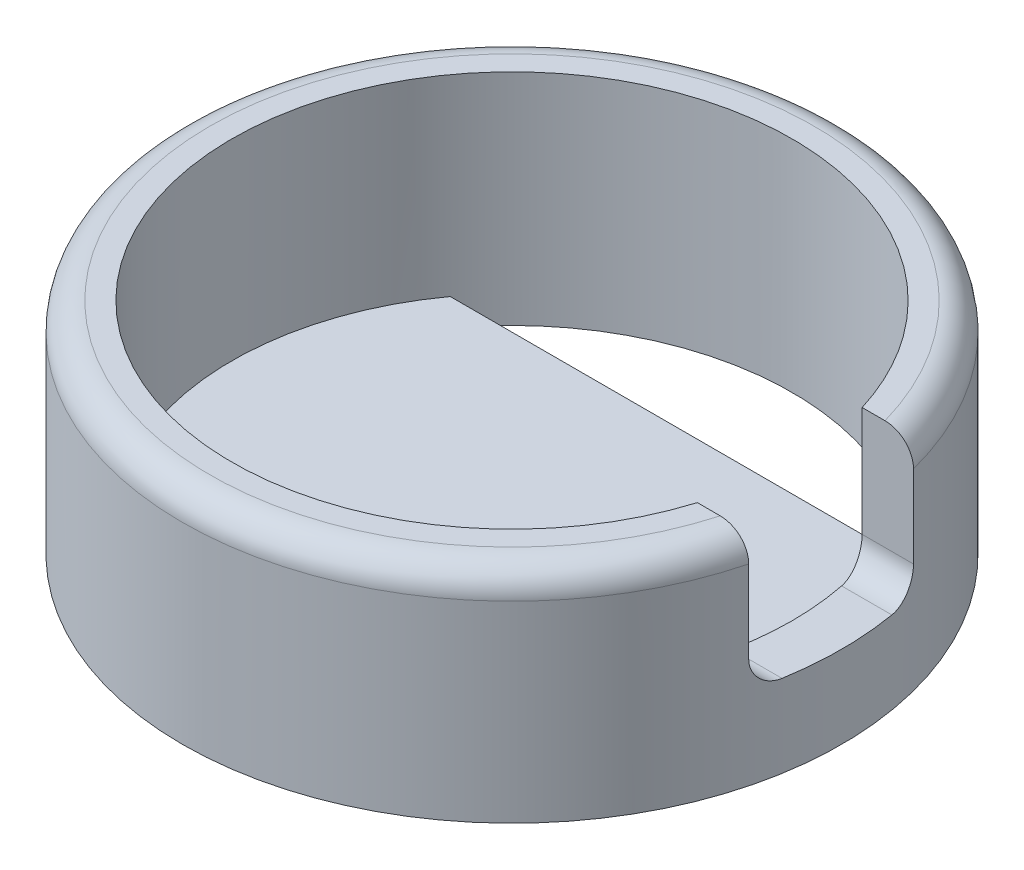
ISO-10303-21;
HEADER;
FILE_DESCRIPTION(('STEP AP214'),'2;1');
FILE_NAME('part.step','',(''),(''),'','','');
FILE_SCHEMA(('AUTOMOTIVE_DESIGN { 1 0 10303 214 1 1 1 1 }'));
ENDSEC;
DATA;
#1=APPLICATION_CONTEXT('core data for automotive mechanical design processes');
#2=APPLICATION_PROTOCOL_DEFINITION('international standard','automotive_design',2000,#1);
#3=PRODUCT_CONTEXT('',#1,'mechanical');
#4=PRODUCT('Part','Part','',(#3));
#5=PRODUCT_RELATED_PRODUCT_CATEGORY('part','',(#4));
#6=PRODUCT_DEFINITION_FORMATION('','',#4);
#7=PRODUCT_DEFINITION_CONTEXT('part definition',#1,'design');
#8=PRODUCT_DEFINITION('design','',#6,#7);
#9=PRODUCT_DEFINITION_SHAPE('','',#8);
#10=(LENGTH_UNIT() NAMED_UNIT(*) SI_UNIT(.MILLI.,.METRE.));
#11=(NAMED_UNIT(*) PLANE_ANGLE_UNIT() SI_UNIT($,.RADIAN.));
#12=(NAMED_UNIT(*) SI_UNIT($,.STERADIAN.) SOLID_ANGLE_UNIT());
#13=UNCERTAINTY_MEASURE_WITH_UNIT(LENGTH_MEASURE(1.E-05),#10,'distance_accuracy_value','');
#14=(GEOMETRIC_REPRESENTATION_CONTEXT(3) GLOBAL_UNCERTAINTY_ASSIGNED_CONTEXT((#13)) GLOBAL_UNIT_ASSIGNED_CONTEXT((#10,
#11,#12)) REPRESENTATION_CONTEXT('',''));
#15=CARTESIAN_POINT('',(0.,0.,0.));
#16=DIRECTION('',(0.,0.,1.));
#17=DIRECTION('',(1.,0.,0.));
#18=AXIS2_PLACEMENT_3D('',#15,#16,#17);
#19=CARTESIAN_POINT('',(0.,0.,0.));
#20=DIRECTION('',(0.,-1.,0.));
#21=DIRECTION('',(0.,0.,-1.));
#22=AXIS2_PLACEMENT_3D('',#19,#20,#21);
#23=PLANE('',#22);
#24=CARTESIAN_POINT('',(0.,0.,0.));
#25=DIRECTION('',(0.,1.,0.));
#26=DIRECTION('',(0.,0.,1.));
#27=AXIS2_PLACEMENT_3D('',#24,#25,#26);
#28=CIRCLE('',#27,5.1);
#29=CARTESIAN_POINT('',(4.12431812546026,0.,3.));
#30=VERTEX_POINT('',#29);
#31=CARTESIAN_POINT('',(4.12431812546026,0.,-3.));
#32=VERTEX_POINT('',#31);
#33=EDGE_CURVE('E171',#30,#32,#28,.T.);
#34=ORIENTED_EDGE('',*,*,#33,.T.);
#35=DIRECTION('',(1.,0.,0.));
#36=VECTOR('',#35,1.);
#37=CARTESIAN_POINT('',(4.12431812546025,0.,-3.));
#38=LINE('',#37,#36);
#39=CARTESIAN_POINT('',(-4.12431812546025,0.,-3.));
#40=VERTEX_POINT('',#39);
#41=EDGE_CURVE('E140',#40,#32,#38,.T.);
#42=ORIENTED_EDGE('',*,*,#41,.F.);
#43=CARTESIAN_POINT('',(-4.12431812546025,0.,3.));
#44=VERTEX_POINT('',#43);
#45=EDGE_CURVE('E128',#40,#44,#28,.T.);
#46=ORIENTED_EDGE('',*,*,#45,.T.);
#47=DIRECTION('',(-1.,0.,0.));
#48=VECTOR('',#47,1.);
#49=CARTESIAN_POINT('',(4.12431812546025,0.,3.));
#50=LINE('',#49,#48);
#51=EDGE_CURVE('E144',#30,#44,#50,.T.);
#52=ORIENTED_EDGE('',*,*,#51,.F.);
#53=EDGE_LOOP('',(#34,#42,#46,#52));
#54=FACE_BOUND('',#53,.T.);
#55=ADVANCED_FACE('F32',(#54),#23,.F.);
#56=CARTESIAN_POINT('',(0.,3.5,0.));
#57=DIRECTION('',(0.,1.,0.));
#58=DIRECTION('',(0.,0.,1.));
#59=AXIS2_PLACEMENT_3D('',#56,#57,#58);
#60=PLANE('',#59);
#61=DIRECTION('',(1.,0.,0.));
#62=VECTOR('',#61,1.);
#63=CARTESIAN_POINT('',(0.,3.5,-1.5));
#64=LINE('',#63,#62);
#65=CARTESIAN_POINT('',(4.87442304278157,3.5,-1.5));
#66=VERTEX_POINT('',#65);
#67=CARTESIAN_POINT('',(5.29150262212918,3.5,-1.5));
#68=VERTEX_POINT('',#67);
#69=EDGE_CURVE('E155',#66,#68,#64,.T.);
#70=ORIENTED_EDGE('',*,*,#69,.T.);
#71=CARTESIAN_POINT('',(0.,3.5,0.));
#72=DIRECTION('',(0.,1.,0.));
#73=DIRECTION('',(0.,0.,1.));
#74=AXIS2_PLACEMENT_3D('',#71,#72,#73);
#75=CIRCLE('',#74,5.5);
#76=CARTESIAN_POINT('',(5.29150262212918,3.5,1.5));
#77=VERTEX_POINT('',#76);
#78=EDGE_CURVE('E173',#68,#77,#75,.T.);
#79=ORIENTED_EDGE('',*,*,#78,.T.);
#80=DIRECTION('',(-1.,0.,0.));
#81=VECTOR('',#80,1.);
#82=CARTESIAN_POINT('',(0.,3.5,1.5));
#83=LINE('',#82,#81);
#84=CARTESIAN_POINT('',(4.87442304278157,3.5,1.5));
#85=VERTEX_POINT('',#84);
#86=EDGE_CURVE('E252',#77,#85,#83,.T.);
#87=ORIENTED_EDGE('',*,*,#86,.T.);
#88=CARTESIAN_POINT('',(0.,3.5,0.));
#89=DIRECTION('',(0.,1.,0.));
#90=DIRECTION('',(0.,0.,1.));
#91=AXIS2_PLACEMENT_3D('',#88,#89,#90);
#92=CIRCLE('',#91,5.1);
#93=EDGE_CURVE('E266',#66,#85,#92,.T.);
#94=ORIENTED_EDGE('',*,*,#93,.F.);
#95=EDGE_LOOP('',(#70,#79,#87,#94));
#96=FACE_BOUND('',#95,.T.);
#97=ADVANCED_FACE('F220',(#96),#60,.T.);
#98=CARTESIAN_POINT('',(0.,3.5,0.));
#99=DIRECTION('',(0.,-1.,0.));
#100=DIRECTION('',(0.,0.,-1.));
#101=AXIS2_PLACEMENT_3D('',#98,#99,#100);
#102=CYLINDRICAL_SURFACE('',#101,6.);
#103=CARTESIAN_POINT('',(0.,-0.5,0.));
#104=DIRECTION('',(0.,-1.,0.));
#105=DIRECTION('',(0.,0.,-1.));
#106=AXIS2_PLACEMENT_3D('',#103,#104,#105);
#107=CIRCLE('',#106,6.);
#108=CARTESIAN_POINT('',(0.,-0.5,-6.));
#109=VERTEX_POINT('',#108);
#110=EDGE_CURVE('E172',#109,#109,#107,.T.);
#111=ORIENTED_EDGE('',*,*,#110,.F.);
#112=EDGE_LOOP('',(#111));
#113=FACE_BOUND('',#112,.T.);
#114=DIRECTION('',(0.,-1.,0.));
#115=VECTOR('',#114,1.);
#116=CARTESIAN_POINT('',(5.80947501931113,3.5,1.5));
#117=LINE('',#116,#115);
#118=CARTESIAN_POINT('',(5.80947501931113,3.,1.5));
#119=VERTEX_POINT('',#118);
#120=CARTESIAN_POINT('',(5.80947501931113,1.5,1.5));
#121=VERTEX_POINT('',#120);
#122=EDGE_CURVE('E251',#119,#121,#117,.T.);
#123=ORIENTED_EDGE('',*,*,#122,.F.);
#124=CARTESIAN_POINT('',(0.,3.,0.));
#125=DIRECTION('',(0.,1.,0.));
#126=DIRECTION('',(0.,0.,1.));
#127=AXIS2_PLACEMENT_3D('',#124,#125,#126);
#128=CIRCLE('',#127,6.);
#129=CARTESIAN_POINT('',(5.80947501931113,3.,-1.5));
#130=VERTEX_POINT('',#129);
#131=EDGE_CURVE('E187',#119,#130,#128,.F.);
#132=ORIENTED_EDGE('',*,*,#131,.T.);
#133=DIRECTION('',(0.,-1.,0.));
#134=VECTOR('',#133,1.);
#135=CARTESIAN_POINT('',(5.80947501931113,3.5,-1.5));
#136=LINE('',#135,#134);
#137=CARTESIAN_POINT('',(5.80947501931113,1.5,-1.5));
#138=VERTEX_POINT('',#137);
#139=EDGE_CURVE('E245',#138,#130,#136,.F.);
#140=ORIENTED_EDGE('',*,*,#139,.F.);
#141=CARTESIAN_POINT('',(5.80947501931113,1.5,-1.5));
#142=CARTESIAN_POINT('',(5.80946260272225,1.47245234394303,-1.5000264388775));
#143=CARTESIAN_POINT('',(5.81006232529152,1.44491875321877,-1.49772513568713));
#144=CARTESIAN_POINT('',(5.81239183886436,1.39069268979506,-1.48867054127598));
#145=CARTESIAN_POINT('',(5.81411955169529,1.36399876473653,-1.48192543696267));
#146=CARTESIAN_POINT('',(5.81861164863412,1.31215613754131,-1.46418467978733));
#147=CARTESIAN_POINT('',(5.82137611529369,1.28700755863868,-1.45318868844561));
#148=CARTESIAN_POINT('',(5.82777770640467,1.23892533964038,-1.42730002983229));
#149=CARTESIAN_POINT('',(5.83141495801916,1.21599202298769,-1.41240679471109));
#150=CARTESIAN_POINT('',(5.83943185842595,1.17257483931313,-1.37888943193051));
#151=CARTESIAN_POINT('',(5.8438226013859,1.15213678395909,-1.36020865851627));
#152=CARTESIAN_POINT('',(5.85308115729669,1.11465845161131,-1.31979926314509));
#153=CARTESIAN_POINT('',(5.85794910314797,1.09761912519205,-1.29806979139856));
#154=CARTESIAN_POINT('',(5.86807359237805,1.06694381207257,-1.25151686538783));
#155=CARTESIAN_POINT('',(5.87333714435984,1.05341443104465,-1.22662470361615));
#156=CARTESIAN_POINT('',(5.88389673242732,1.03074930338266,-1.17492720494232));
#157=CARTESIAN_POINT('',(5.88919275307265,1.02161161102753,-1.14812272134344));
#158=CARTESIAN_POINT('',(5.89814802867448,1.00989039601375,-1.1010233989768));
#159=CARTESIAN_POINT('',(5.90185029888455,1.00618802406004,-1.08100778606736));
#160=CARTESIAN_POINT('',(5.90909720818695,1.00124239117992,-1.04067055279438));
#161=CARTESIAN_POINT('',(5.91264201779594,0.99999640343558,-1.02034929701292));
#162=CARTESIAN_POINT('',(5.91607978309962,1.,-1.));
#163=B_SPLINE_CURVE_WITH_KNOTS('',3,(#141,#142,#143,#144,#145,#146,#147,#148,#149,#150,#151,
#152,#153,#154,#155,#156,#157,#158,#159,#160,#161,#162),.UNSPECIFIED.,.F.,.F.,(4,2,2,2,2,2,2,2,
2,2,4),(0.,0.0825190739674022,0.164886544864223,0.247260575676912,0.329646615522718,
0.413370197857709,0.497117163713627,0.583169637417716,0.669183950673288,0.731109654210456,
0.792966575586024),.UNSPECIFIED.);
#164=CARTESIAN_POINT('',(5.91607978309962,1.,-1.));
#165=VERTEX_POINT('',#164);
#166=EDGE_CURVE('E45',#138,#165,#163,.T.);
#167=ORIENTED_EDGE('',*,*,#166,.T.);
#168=CARTESIAN_POINT('',(0.,1.,0.));
#169=DIRECTION('',(0.,-1.,0.));
#170=DIRECTION('',(0.,0.,-1.));
#171=AXIS2_PLACEMENT_3D('',#168,#169,#170);
#172=CIRCLE('',#171,6.);
#173=CARTESIAN_POINT('',(5.91607978309962,1.,1.));
#174=VERTEX_POINT('',#173);
#175=EDGE_CURVE('E242',#165,#174,#172,.T.);
#176=ORIENTED_EDGE('',*,*,#175,.T.);
#177=CARTESIAN_POINT('',(5.91607978309962,1.,1.));
#178=CARTESIAN_POINT('',(5.91124844688036,0.999978854490423,1.02863076528655));
#179=CARTESIAN_POINT('',(5.90619562137501,1.00245763755017,1.0572122635172));
#180=CARTESIAN_POINT('',(5.89584284522348,1.01221729737715,1.11347612360845));
#181=CARTESIAN_POINT('',(5.89054308215667,1.01949458262758,1.14115914170437));
#182=CARTESIAN_POINT('',(5.8798830515727,1.03865661381043,1.19487780890017));
#183=CARTESIAN_POINT('',(5.87452276814994,1.05054259969208,1.22091301246864));
#184=CARTESIAN_POINT('',(5.86397538489915,1.07858989055555,1.27060482095105));
#185=CARTESIAN_POINT('',(5.85878826840729,1.09475078282027,1.29426165517847));
#186=CARTESIAN_POINT('',(5.84882871455614,1.13094460117043,1.33855140011155));
#187=CARTESIAN_POINT('',(5.84405675928205,1.15098194383714,1.35918081396686));
#188=CARTESIAN_POINT('',(5.83518768297033,1.19438636263682,1.39676716424024));
#189=CARTESIAN_POINT('',(5.83109063783287,1.21775381272213,1.41372368767373));
#190=CARTESIAN_POINT('',(5.82387518217024,1.26673249328472,1.44315778903523));
#191=CARTESIAN_POINT('',(5.82074106784856,1.2922979140944,1.45570777604623));
#192=CARTESIAN_POINT('',(5.81555164563027,1.34527358514939,1.47630380393845));
#193=CARTESIAN_POINT('',(5.81349525719888,1.37268195640367,1.48435435652113));
#194=CARTESIAN_POINT('',(5.81119297097694,1.416931541816,1.49333436328146));
#195=CARTESIAN_POINT('',(5.81054998706872,1.43344990261393,1.49583211860708));
#196=CARTESIAN_POINT('',(5.80969073993498,1.46664269790988,1.49916462086055));
#197=CARTESIAN_POINT('',(5.8094739230246,1.48331690157985,1.50000152561307));
#198=CARTESIAN_POINT('',(5.80947501931113,1.5,1.5));
#199=B_SPLINE_CURVE_WITH_KNOTS('',3,(#177,#178,#179,#180,#181,#182,#183,#184,#185,#186,#187,
#188,#189,#190,#191,#192,#193,#194,#195,#196,#197,#198),.UNSPECIFIED.,.F.,.F.,(4,2,2,2,2,2,2,2,
2,2,4),(0.,0.086983738657892,0.173902446713839,0.260844556084092,0.347778274765876,
0.434811629800413,0.521854765904096,0.607392095030617,0.69284349903057,0.742918224722482,
0.792927849191008),.UNSPECIFIED.);
#200=EDGE_CURVE('E230',#174,#121,#199,.T.);
#201=ORIENTED_EDGE('',*,*,#200,.T.);
#202=EDGE_LOOP('',(#123,#132,#140,#167,#176,#201));
#203=FACE_BOUND('',#202,.T.);
#204=ADVANCED_FACE('F199',(#113,#203),#102,.T.);
#205=CARTESIAN_POINT('',(0.,3.5,0.));
#206=DIRECTION('',(0.,-1.,0.));
#207=DIRECTION('',(0.,0.,-1.));
#208=AXIS2_PLACEMENT_3D('',#205,#206,#207);
#209=CYLINDRICAL_SURFACE('',#208,5.1);
#210=ORIENTED_EDGE('',*,*,#33,.F.);
#211=DIRECTION('',(0.,1.,0.));
#212=VECTOR('',#211,1.);
#213=CARTESIAN_POINT('',(4.12431812546025,-0.5,3.));
#214=LINE('',#213,#212);
#215=CARTESIAN_POINT('',(4.12431812546025,-0.5,3.));
#216=VERTEX_POINT('',#215);
#217=EDGE_CURVE('E152',#216,#30,#214,.T.);
#218=ORIENTED_EDGE('',*,*,#217,.F.);
#219=CARTESIAN_POINT('',(0.,-0.5,0.));
#220=DIRECTION('',(0.,1.,0.));
#221=DIRECTION('',(0.,0.,1.));
#222=AXIS2_PLACEMENT_3D('',#219,#220,#221);
#223=CIRCLE('',#222,5.1);
#224=CARTESIAN_POINT('',(-4.12431812546025,-0.5,3.));
#225=VERTEX_POINT('',#224);
#226=EDGE_CURVE('E146',#225,#216,#223,.T.);
#227=ORIENTED_EDGE('',*,*,#226,.F.);
#228=DIRECTION('',(0.,1.,0.));
#229=VECTOR('',#228,1.);
#230=CARTESIAN_POINT('',(-4.12431812546025,-0.5,3.));
#231=LINE('',#230,#229);
#232=EDGE_CURVE('E164',#225,#44,#231,.T.);
#233=ORIENTED_EDGE('',*,*,#232,.T.);
#234=ORIENTED_EDGE('',*,*,#45,.F.);
#235=DIRECTION('',(0.,1.,0.));
#236=VECTOR('',#235,1.);
#237=CARTESIAN_POINT('',(-4.12431812546025,-0.5,-3.));
#238=LINE('',#237,#236);
#239=CARTESIAN_POINT('',(-4.12431812546025,-0.5,-3.));
#240=VERTEX_POINT('',#239);
#241=EDGE_CURVE('E119',#240,#40,#238,.T.);
#242=ORIENTED_EDGE('',*,*,#241,.F.);
#243=CARTESIAN_POINT('',(0.,-0.5,0.));
#244=DIRECTION('',(0.,1.,0.));
#245=DIRECTION('',(0.,0.,1.));
#246=AXIS2_PLACEMENT_3D('',#243,#244,#245);
#247=CIRCLE('',#246,5.1);
#248=CARTESIAN_POINT('',(4.12431812546025,-0.5,-3.));
#249=VERTEX_POINT('',#248);
#250=EDGE_CURVE('E125',#249,#240,#247,.T.);
#251=ORIENTED_EDGE('',*,*,#250,.F.);
#252=DIRECTION('',(0.,1.,0.));
#253=VECTOR('',#252,1.);
#254=CARTESIAN_POINT('',(4.12431812546025,-0.5,-3.));
#255=LINE('',#254,#253);
#256=EDGE_CURVE('E131',#249,#32,#255,.T.);
#257=ORIENTED_EDGE('',*,*,#256,.T.);
#258=EDGE_LOOP('',(#210,#218,#227,#233,#234,#242,#251,#257));
#259=FACE_BOUND('',#258,.T.);
#260=CARTESIAN_POINT('',(0.,1.,0.));
#261=DIRECTION('',(0.,-1.,0.));
#262=DIRECTION('',(0.,0.,-1.));
#263=AXIS2_PLACEMENT_3D('',#260,#261,#262);
#264=CIRCLE('',#263,5.1);
#265=CARTESIAN_POINT('',(5.00099990001999,1.,-1.));
#266=VERTEX_POINT('',#265);
#267=CARTESIAN_POINT('',(5.00099990001999,1.,1.));
#268=VERTEX_POINT('',#267);
#269=EDGE_CURVE('E258',#266,#268,#264,.T.);
#270=ORIENTED_EDGE('',*,*,#269,.F.);
#271=CARTESIAN_POINT('',(5.00099990001999,1.,-1.));
#272=CARTESIAN_POINT('',(4.99524462935413,0.999980021595628,-1.02883128245326));
#273=CARTESIAN_POINT('',(4.98922410019139,1.00249215766315,-1.05759562912131));
#274=CARTESIAN_POINT('',(4.97688567558653,1.0123736094447,-1.11419072741617));
#275=CARTESIAN_POINT('',(4.97056800463574,1.0197393113242,-1.14202215747777));
#276=CARTESIAN_POINT('',(4.95785805826047,1.03912317450378,-1.19600177662717));
#277=CARTESIAN_POINT('',(4.95146576955946,1.05114217637864,-1.22214966060236));
#278=CARTESIAN_POINT('',(4.93888425892198,1.07950305255695,-1.27203884808522));
#279=CARTESIAN_POINT('',(4.93269502536403,1.09584467897616,-1.29578028948425));
#280=CARTESIAN_POINT('',(4.92080672071359,1.13246741107755,-1.34022110401282));
#281=CARTESIAN_POINT('',(4.91510852924713,1.15275538270001,-1.36091506318625));
#282=CARTESIAN_POINT('',(4.90452459530678,1.19672992160153,-1.39857860407643));
#283=CARTESIAN_POINT('',(4.89963891308133,1.2204167406664,-1.41554790963592));
#284=CARTESIAN_POINT('',(4.89108493097513,1.26991583307447,-1.44482386752038));
#285=CARTESIAN_POINT('',(4.88738986477021,1.29566224053703,-1.45723407189288));
#286=CARTESIAN_POINT('',(4.88129869811224,1.34901649468398,-1.47751017309827));
#287=CARTESIAN_POINT('',(4.87890106624748,1.37662210339337,-1.48538142815157));
#288=CARTESIAN_POINT('',(4.87630248298636,1.42039684378826,-1.4938820714461));
#289=CARTESIAN_POINT('',(4.87559903329448,1.43623166878473,-1.49617451857705));
#290=CARTESIAN_POINT('',(4.87465907010274,1.46804149322557,-1.49923312289983));
#291=CARTESIAN_POINT('',(4.87442196908297,1.48401629079573,-1.50000120054869));
#292=CARTESIAN_POINT('',(4.87442304278157,1.5,-1.5));
#293=B_SPLINE_CURVE_WITH_KNOTS('',3,(#271,#272,#273,#274,#275,#276,#277,#278,#279,#280,#281,
#282,#283,#284,#285,#286,#287,#288,#289,#290,#291,#292),.UNSPECIFIED.,.F.,.F.,(4,2,2,2,2,2,2,2,
2,2,4),(0.,0.0880728531703784,0.176080203650196,0.264103459251456,0.352121668185034,
0.440294405457678,0.528473677921285,0.614503993785199,0.700432542024944,0.748406616564838,
0.796320213128475),.UNSPECIFIED.);
#294=CARTESIAN_POINT('',(4.87442304278157,1.5,-1.5));
#295=VERTEX_POINT('',#294);
#296=EDGE_CURVE('E11',#266,#295,#293,.T.);
#297=ORIENTED_EDGE('',*,*,#296,.T.);
#298=DIRECTION('',(0.,-1.,0.));
#299=VECTOR('',#298,1.);
#300=CARTESIAN_POINT('',(4.87442304278157,3.5,-1.5));
#301=LINE('',#300,#299);
#302=EDGE_CURVE('E177',#295,#66,#301,.F.);
#303=ORIENTED_EDGE('',*,*,#302,.T.);
#304=ORIENTED_EDGE('',*,*,#93,.T.);
#305=DIRECTION('',(0.,-1.,0.));
#306=VECTOR('',#305,1.);
#307=CARTESIAN_POINT('',(4.87442304278157,3.5,1.5));
#308=LINE('',#307,#306);
#309=CARTESIAN_POINT('',(4.87442304278157,1.5,1.5));
#310=VERTEX_POINT('',#309);
#311=EDGE_CURVE('E261',#85,#310,#308,.T.);
#312=ORIENTED_EDGE('',*,*,#311,.T.);
#313=CARTESIAN_POINT('',(4.87442304278157,1.5,1.5));
#314=CARTESIAN_POINT('',(4.87440806675165,1.47267923955703,1.50002735114864));
#315=CARTESIAN_POINT('',(4.87511149860236,1.44537526181536,1.49776259823149));
#316=CARTESIAN_POINT('',(4.8778404490061,1.39161748639047,1.48886229161));
#317=CARTESIAN_POINT('',(4.87986300610148,1.36516192325218,1.4822365281404));
#318=CARTESIAN_POINT('',(4.88511620713837,1.31379062222735,1.46482658042211));
#319=CARTESIAN_POINT('',(4.88834675534032,1.28887476249363,1.45404272572159));
#320=CARTESIAN_POINT('',(4.89582076842242,1.24122304607688,1.42867576306013));
#321=CARTESIAN_POINT('',(4.90006450347024,1.21848777312078,1.41409164165778));
#322=CARTESIAN_POINT('',(4.90944063421521,1.17527402871468,1.38119171509789));
#323=CARTESIAN_POINT('',(4.91459083267142,1.15485763969307,1.36279952294346));
#324=CARTESIAN_POINT('',(4.92544994763974,1.11736560573165,1.32301458865338));
#325=CARTESIAN_POINT('',(4.9311590352091,1.10029098842237,1.30162092699508));
#326=CARTESIAN_POINT('',(4.9431004282841,1.06929446357905,1.2555260753091));
#327=CARTESIAN_POINT('',(4.94934441548125,1.05551924935344,1.23072925428758));
#328=CARTESIAN_POINT('',(4.9618779658237,1.03235521517943,1.17918172141277));
#329=CARTESIAN_POINT('',(4.96816751036516,1.02296469708738,1.15243177063394));
#330=CARTESIAN_POINT('',(4.97896471596309,1.01063028473253,1.10469294342315));
#331=CARTESIAN_POINT('',(4.98351763713465,1.00665295429796,1.08397519642844));
#332=CARTESIAN_POINT('',(4.99242575884392,1.00133705034966,1.04218409863334));
#333=CARTESIAN_POINT('',(4.99678114831568,0.999995901077546,1.02111111525777));
#334=CARTESIAN_POINT('',(5.00099990001999,1.,1.));
#335=B_SPLINE_CURVE_WITH_KNOTS('',3,(#313,#314,#315,#316,#317,#318,#319,#320,#321,#322,#323,
#324,#325,#326,#327,#328,#329,#330,#331,#332,#333,#334),.UNSPECIFIED.,.F.,.F.,(4,2,2,2,2,2,2,2,
2,2,4),(0.,0.0818337318865814,0.163484375186885,0.245128548621644,0.326794516951894,
0.410292854650928,0.493816828776875,0.580556571827983,0.667262693628539,0.731850089927878,
0.79637434777932),.UNSPECIFIED.);
#336=EDGE_CURVE('E52',#310,#268,#335,.T.);
#337=ORIENTED_EDGE('',*,*,#336,.T.);
#338=EDGE_LOOP('',(#270,#297,#303,#304,#312,#337));
#339=FACE_BOUND('',#338,.T.);
#340=ADVANCED_FACE('F122',(#259,#339),#209,.F.);
#341=CARTESIAN_POINT('',(0.,-0.5,0.));
#342=DIRECTION('',(0.,-1.,0.));
#343=DIRECTION('',(0.,0.,-1.));
#344=AXIS2_PLACEMENT_3D('',#341,#342,#343);
#345=PLANE('',#344);
#346=ORIENTED_EDGE('',*,*,#250,.T.);
#347=DIRECTION('',(1.,0.,0.));
#348=VECTOR('',#347,1.);
#349=CARTESIAN_POINT('',(4.12431812546025,-0.5,-3.));
#350=LINE('',#349,#348);
#351=EDGE_CURVE('E132',#240,#249,#350,.T.);
#352=ORIENTED_EDGE('',*,*,#351,.T.);
#353=EDGE_LOOP('',(#346,#352));
#354=FACE_BOUND('',#353,.T.);
#355=ORIENTED_EDGE('',*,*,#226,.T.);
#356=DIRECTION('',(-1.,0.,0.));
#357=VECTOR('',#356,1.);
#358=CARTESIAN_POINT('',(4.12431812546025,-0.5,3.));
#359=LINE('',#358,#357);
#360=EDGE_CURVE('E149',#216,#225,#359,.T.);
#361=ORIENTED_EDGE('',*,*,#360,.T.);
#362=EDGE_LOOP('',(#355,#361));
#363=FACE_BOUND('',#362,.T.);
#364=ORIENTED_EDGE('',*,*,#110,.T.);
#365=EDGE_LOOP('',(#364));
#366=FACE_BOUND('',#365,.T.);
#367=ADVANCED_FACE('F138',(#354,#363,#366),#345,.T.);
#368=CARTESIAN_POINT('',(0.,1.,-1.5));
#369=DIRECTION('',(0.,0.,1.));
#370=DIRECTION('',(1.,0.,0.));
#371=AXIS2_PLACEMENT_3D('',#368,#369,#370);
#372=PLANE('',#371);
#373=ORIENTED_EDGE('',*,*,#139,.T.);
#374=CARTESIAN_POINT('',(5.80947501931113,3.,-1.5));
#375=CARTESIAN_POINT('',(5.80950227872987,3.02746760657096,-1.5));
#376=CARTESIAN_POINT('',(5.80713916462104,3.0549232377484,-1.5));
#377=CARTESIAN_POINT('',(5.79783908780219,3.10900436697722,-1.5));
#378=CARTESIAN_POINT('',(5.79090958667919,3.13563114518827,-1.5));
#379=CARTESIAN_POINT('',(5.77268065743451,3.18734787109026,-1.5));
#380=CARTESIAN_POINT('',(5.76138038775566,3.21243752174102,-1.5));
#381=CARTESIAN_POINT('',(5.73478226547778,3.26039693234626,-1.5));
#382=CARTESIAN_POINT('',(5.71948417735584,3.283266561404,-1.5));
#383=CARTESIAN_POINT('',(5.68513882339443,3.3264748795103,-1.5));
#384=CARTESIAN_POINT('',(5.66604571946816,3.3467770956013,-1.5));
#385=CARTESIAN_POINT('',(5.62480941825856,3.38400443166236,-1.5));
#386=CARTESIAN_POINT('',(5.60266555920087,3.4009288169525,-1.5));
#387=CARTESIAN_POINT('',(5.55524646013606,3.43147060867013,-1.5));
#388=CARTESIAN_POINT('',(5.52989650764971,3.4449718834679,-1.5));
#389=CARTESIAN_POINT('',(5.47734122678453,3.46768027998512,-1.5));
#390=CARTESIAN_POINT('',(5.45013598738559,3.47688760747723,-1.5));
#391=CARTESIAN_POINT('',(5.40099020189629,3.48922611245479,-1.5));
#392=CARTESIAN_POINT('',(5.379272495983,3.49326634705547,-1.5));
#393=CARTESIAN_POINT('',(5.33553892368698,3.49865330537333,-1.5));
#394=CARTESIAN_POINT('',(5.31352356123787,3.50000411796428,-1.5));
#395=CARTESIAN_POINT('',(5.29150262212918,3.5,-1.5));
#396=B_SPLINE_CURVE_WITH_KNOTS('',3,(#374,#375,#376,#377,#378,#379,#380,#381,#382,#383,#384,
#385,#386,#387,#388,#389,#390,#391,#392,#393,#394,#395),.UNSPECIFIED.,.F.,.F.,(4,2,2,2,2,2,2,2,
2,2,4),(0.,0.0822832708119111,0.164432421055297,0.246597396353051,0.328767213316142,
0.411997497345877,0.495245864324011,0.581024187394147,0.666798399410376,0.732909058241704,
0.798919128474184),.UNSPECIFIED.);
#397=EDGE_CURVE('E205',#130,#68,#396,.T.);
#398=ORIENTED_EDGE('',*,*,#397,.T.);
#399=ORIENTED_EDGE('',*,*,#69,.F.);
#400=ORIENTED_EDGE('',*,*,#302,.F.);
#401=DIRECTION('',(1.,0.,0.));
#402=VECTOR('',#401,1.);
#403=CARTESIAN_POINT('',(0.,1.5,-1.5));
#404=LINE('',#403,#402);
#405=EDGE_CURVE('E210',#295,#138,#404,.T.);
#406=ORIENTED_EDGE('',*,*,#405,.T.);
#407=EDGE_LOOP('',(#373,#398,#399,#400,#406));
#408=FACE_BOUND('',#407,.T.);
#409=ADVANCED_FACE('F212',(#408),#372,.T.);
#410=CARTESIAN_POINT('',(0.,1.,1.5));
#411=DIRECTION('',(0.,0.,-1.));
#412=DIRECTION('',(-1.,0.,0.));
#413=AXIS2_PLACEMENT_3D('',#410,#411,#412);
#414=PLANE('',#413);
#415=ORIENTED_EDGE('',*,*,#86,.F.);
#416=CARTESIAN_POINT('',(5.29150262212918,3.5,1.5));
#417=CARTESIAN_POINT('',(5.32146688132314,3.50002089056905,1.5));
#418=CARTESIAN_POINT('',(5.35143339537252,3.49750775655338,1.5));
#419=CARTESIAN_POINT('',(5.41054663910723,3.48753733434825,1.5));
#420=CARTESIAN_POINT('',(5.43969297033068,3.48007768483638,1.5));
#421=CARTESIAN_POINT('',(5.49633976133888,3.4603284321407,1.5));
#422=CARTESIAN_POINT('',(5.52383853831459,3.44803398445085,1.5));
#423=CARTESIAN_POINT('',(5.57630701047069,3.4189124956653,1.5));
#424=CARTESIAN_POINT('',(5.6012781276921,3.40208802284603,1.5));
#425=CARTESIAN_POINT('',(5.64740929624115,3.36473174676593,1.5));
#426=CARTESIAN_POINT('',(5.66863848245369,3.34428540052066,1.5));
#427=CARTESIAN_POINT('',(5.70722040134455,3.30000021358724,1.5));
#428=CARTESIAN_POINT('',(5.7245726569358,3.27616095596466,1.5));
#429=CARTESIAN_POINT('',(5.75427554639923,3.22664700731093,1.5));
#430=CARTESIAN_POINT('',(5.76677572525865,3.20106187189186,1.5));
#431=CARTESIAN_POINT('',(5.78715159880962,3.14812504039779,1.5));
#432=CARTESIAN_POINT('',(5.79503226300242,3.12077527794507,1.5));
#433=CARTESIAN_POINT('',(5.80346381239056,3.07765491319325,1.5));
#434=CARTESIAN_POINT('',(5.80571701057418,3.06219859733672,1.5));
#435=CARTESIAN_POINT('',(5.80872189305115,3.03116409347343,1.5));
#436=CARTESIAN_POINT('',(5.80947581996945,3.01558612253667,1.5));
#437=CARTESIAN_POINT('',(5.80947501931164,3.0000000000001,1.5));
#438=B_SPLINE_CURVE_WITH_KNOTS('',3,(#416,#417,#418,#419,#420,#421,#422,#423,#424,#425,#426,
#427,#428,#429,#430,#431,#432,#433,#434,#435,#436,#437),.UNSPECIFIED.,.F.,.F.,(4,2,2,2,2,2,2,2,
2,2,4),(0.,0.0897921223172493,0.179627139665921,0.26955240271703,0.35942679002423,
0.447410079802145,0.535404190665838,0.62041687920606,0.705337945636612,0.752132136344542,
0.798856279026414),.UNSPECIFIED.);
#439=EDGE_CURVE('E180',#77,#119,#438,.T.);
#440=ORIENTED_EDGE('',*,*,#439,.T.);
#441=ORIENTED_EDGE('',*,*,#122,.T.);
#442=DIRECTION('',(-1.,0.,0.));
#443=VECTOR('',#442,1.);
#444=CARTESIAN_POINT('',(0.,1.5,1.5));
#445=LINE('',#444,#443);
#446=EDGE_CURVE('E176',#121,#310,#445,.T.);
#447=ORIENTED_EDGE('',*,*,#446,.T.);
#448=ORIENTED_EDGE('',*,*,#311,.F.);
#449=EDGE_LOOP('',(#415,#440,#441,#447,#448));
#450=FACE_BOUND('',#449,.T.);
#451=ADVANCED_FACE('F189',(#450),#414,.T.);
#452=CARTESIAN_POINT('',(0.,1.,0.));
#453=DIRECTION('',(0.,-1.,0.));
#454=DIRECTION('',(0.,0.,-1.));
#455=AXIS2_PLACEMENT_3D('',#452,#453,#454);
#456=PLANE('',#455);
#457=ORIENTED_EDGE('',*,*,#269,.T.);
#458=DIRECTION('',(-1.,0.,0.));
#459=VECTOR('',#458,1.);
#460=CARTESIAN_POINT('',(0.,1.,1.));
#461=LINE('',#460,#459);
#462=EDGE_CURVE('E231',#268,#174,#461,.F.);
#463=ORIENTED_EDGE('',*,*,#462,.T.);
#464=ORIENTED_EDGE('',*,*,#175,.F.);
#465=DIRECTION('',(1.,0.,0.));
#466=VECTOR('',#465,1.);
#467=CARTESIAN_POINT('',(0.,1.,-1.));
#468=LINE('',#467,#466);
#469=EDGE_CURVE('E59',#165,#266,#468,.F.);
#470=ORIENTED_EDGE('',*,*,#469,.T.);
#471=EDGE_LOOP('',(#457,#463,#464,#470));
#472=FACE_BOUND('',#471,.T.);
#473=ADVANCED_FACE('F249',(#472),#456,.F.);
#474=CARTESIAN_POINT('',(4.12431812546025,-0.5,3.));
#475=DIRECTION('',(0.,0.,-1.));
#476=DIRECTION('',(-1.,0.,0.));
#477=AXIS2_PLACEMENT_3D('',#474,#475,#476);
#478=PLANE('',#477);
#479=ORIENTED_EDGE('',*,*,#51,.T.);
#480=ORIENTED_EDGE('',*,*,#232,.F.);
#481=ORIENTED_EDGE('',*,*,#360,.F.);
#482=ORIENTED_EDGE('',*,*,#217,.T.);
#483=EDGE_LOOP('',(#479,#480,#481,#482));
#484=FACE_BOUND('',#483,.T.);
#485=ADVANCED_FACE('F310',(#484),#478,.F.);
#486=CARTESIAN_POINT('',(4.12431812546025,-0.5,-3.));
#487=DIRECTION('',(0.,0.,1.));
#488=DIRECTION('',(1.,0.,0.));
#489=AXIS2_PLACEMENT_3D('',#486,#487,#488);
#490=PLANE('',#489);
#491=ORIENTED_EDGE('',*,*,#41,.T.);
#492=ORIENTED_EDGE('',*,*,#256,.F.);
#493=ORIENTED_EDGE('',*,*,#351,.F.);
#494=ORIENTED_EDGE('',*,*,#241,.T.);
#495=EDGE_LOOP('',(#491,#492,#493,#494));
#496=FACE_BOUND('',#495,.T.);
#497=ADVANCED_FACE('F135',(#496),#490,.F.);
#498=CARTESIAN_POINT('',(0.,3.,0.));
#499=DIRECTION('',(0.,1.,0.));
#500=DIRECTION('',(0.,0.,1.));
#501=AXIS2_PLACEMENT_3D('',#498,#499,#500);
#502=TOROIDAL_SURFACE('',#501,5.5,0.5);
#503=ORIENTED_EDGE('',*,*,#397,.F.);
#504=ORIENTED_EDGE('',*,*,#131,.F.);
#505=ORIENTED_EDGE('',*,*,#439,.F.);
#506=ORIENTED_EDGE('',*,*,#78,.F.);
#507=EDGE_LOOP('',(#503,#504,#505,#506));
#508=FACE_BOUND('',#507,.T.);
#509=ADVANCED_FACE('F193',(#508),#502,.T.);
#510=CARTESIAN_POINT('',(0.,1.5,1.));
#511=DIRECTION('',(-1.,0.,0.));
#512=DIRECTION('',(0.,0.,1.));
#513=AXIS2_PLACEMENT_3D('',#510,#511,#512);
#514=CYLINDRICAL_SURFACE('',#513,0.5);
#515=ORIENTED_EDGE('',*,*,#200,.F.);
#516=ORIENTED_EDGE('',*,*,#462,.F.);
#517=ORIENTED_EDGE('',*,*,#336,.F.);
#518=ORIENTED_EDGE('',*,*,#446,.F.);
#519=EDGE_LOOP('',(#515,#516,#517,#518));
#520=FACE_BOUND('',#519,.T.);
#521=ADVANCED_FACE('F197',(#520),#514,.F.);
#522=CARTESIAN_POINT('',(0.,1.5,-1.));
#523=DIRECTION('',(1.,0.,0.));
#524=DIRECTION('',(0.,0.,-1.));
#525=AXIS2_PLACEMENT_3D('',#522,#523,#524);
#526=CYLINDRICAL_SURFACE('',#525,0.5);
#527=ORIENTED_EDGE('',*,*,#296,.F.);
#528=ORIENTED_EDGE('',*,*,#469,.F.);
#529=ORIENTED_EDGE('',*,*,#166,.F.);
#530=ORIENTED_EDGE('',*,*,#405,.F.);
#531=EDGE_LOOP('',(#527,#528,#529,#530));
#532=FACE_BOUND('',#531,.T.);
#533=ADVANCED_FACE('F34',(#532),#526,.F.);
#534=CLOSED_SHELL('',(#55,#97,#204,#340,#367,#409,#451,#473,#485,#497,#509,#521,#533));
#535=MANIFOLD_SOLID_BREP('B2',#534);
#536=ADVANCED_BREP_SHAPE_REPRESENTATION('',(#18,#535),#14);
#537=SHAPE_DEFINITION_REPRESENTATION(#9,#536);
ENDSEC;
END-ISO-10303-21;
